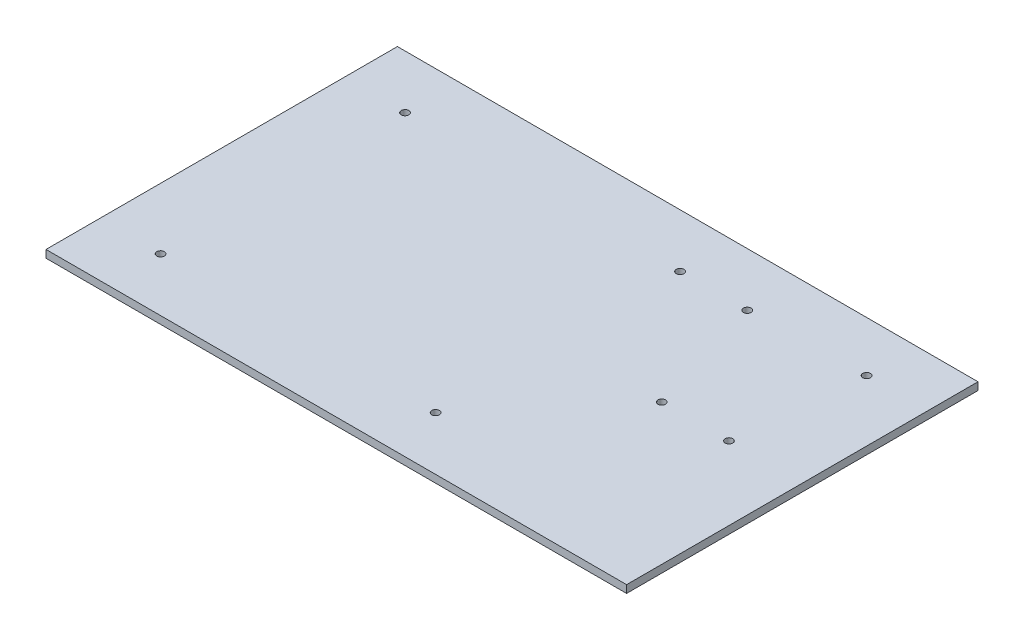
ISO-10303-21;
HEADER;
FILE_DESCRIPTION(('STEP AP214'),'2;1');
FILE_NAME('part.step','',(''),(''),'','','');
FILE_SCHEMA(('AUTOMOTIVE_DESIGN { 1 0 10303 214 1 1 1 1 }'));
ENDSEC;
DATA;
#1=APPLICATION_CONTEXT('core data for automotive mechanical design processes');
#2=APPLICATION_PROTOCOL_DEFINITION('international standard','automotive_design',2000,#1);
#3=PRODUCT_CONTEXT('',#1,'mechanical');
#4=PRODUCT('Part','Part','',(#3));
#5=PRODUCT_RELATED_PRODUCT_CATEGORY('part','',(#4));
#6=PRODUCT_DEFINITION_FORMATION('','',#4);
#7=PRODUCT_DEFINITION_CONTEXT('part definition',#1,'design');
#8=PRODUCT_DEFINITION('design','',#6,#7);
#9=PRODUCT_DEFINITION_SHAPE('','',#8);
#10=(LENGTH_UNIT() NAMED_UNIT(*) SI_UNIT(.MILLI.,.METRE.));
#11=(NAMED_UNIT(*) PLANE_ANGLE_UNIT() SI_UNIT($,.RADIAN.));
#12=(NAMED_UNIT(*) SI_UNIT($,.STERADIAN.) SOLID_ANGLE_UNIT());
#13=UNCERTAINTY_MEASURE_WITH_UNIT(LENGTH_MEASURE(1.E-05),#10,'distance_accuracy_value','');
#14=(GEOMETRIC_REPRESENTATION_CONTEXT(3) GLOBAL_UNCERTAINTY_ASSIGNED_CONTEXT((#13)) GLOBAL_UNIT_ASSIGNED_CONTEXT((#10,
#11,#12)) REPRESENTATION_CONTEXT('',''));
#15=CARTESIAN_POINT('',(0.,0.,0.));
#16=DIRECTION('',(0.,0.,1.));
#17=DIRECTION('',(1.,0.,0.));
#18=AXIS2_PLACEMENT_3D('',#15,#16,#17);
#19=CARTESIAN_POINT('',(120.65,3.175,0.));
#20=DIRECTION('',(1.,0.,0.));
#21=DIRECTION('',(0.,0.,-1.));
#22=AXIS2_PLACEMENT_3D('',#19,#20,#21);
#23=PLANE('',#22);
#24=DIRECTION('',(0.,0.,1.));
#25=VECTOR('',#24,1.);
#26=CARTESIAN_POINT('',(120.65,0.,0.));
#27=LINE('',#26,#25);
#28=CARTESIAN_POINT('',(120.65,0.,-73.025));
#29=VERTEX_POINT('',#28);
#30=CARTESIAN_POINT('',(120.65,0.,73.025));
#31=VERTEX_POINT('',#30);
#32=EDGE_CURVE('E129',#29,#31,#27,.T.);
#33=ORIENTED_EDGE('',*,*,#32,.F.);
#34=DIRECTION('',(0.,-1.,0.));
#35=VECTOR('',#34,1.);
#36=CARTESIAN_POINT('',(120.65,3.175,-73.025));
#37=LINE('',#36,#35);
#38=CARTESIAN_POINT('',(120.65,3.175,-73.025));
#39=VERTEX_POINT('',#38);
#40=EDGE_CURVE('E11',#39,#29,#37,.T.);
#41=ORIENTED_EDGE('',*,*,#40,.F.);
#42=DIRECTION('',(0.,0.,1.));
#43=VECTOR('',#42,1.);
#44=CARTESIAN_POINT('',(120.65,3.175,0.));
#45=LINE('',#44,#43);
#46=CARTESIAN_POINT('',(120.65,3.175,73.025));
#47=VERTEX_POINT('',#46);
#48=EDGE_CURVE('E98',#39,#47,#45,.T.);
#49=ORIENTED_EDGE('',*,*,#48,.T.);
#50=DIRECTION('',(0.,-1.,0.));
#51=VECTOR('',#50,1.);
#52=CARTESIAN_POINT('',(120.65,3.175,73.025));
#53=LINE('',#52,#51);
#54=EDGE_CURVE('E77',#47,#31,#53,.T.);
#55=ORIENTED_EDGE('',*,*,#54,.T.);
#56=EDGE_LOOP('',(#33,#41,#49,#55));
#57=FACE_BOUND('',#56,.T.);
#58=ADVANCED_FACE('F37',(#57),#23,.T.);
#59=CARTESIAN_POINT('',(0.,3.175,-73.025));
#60=DIRECTION('',(0.,0.,-1.));
#61=DIRECTION('',(-1.,0.,0.));
#62=AXIS2_PLACEMENT_3D('',#59,#60,#61);
#63=PLANE('',#62);
#64=DIRECTION('',(1.,0.,0.));
#65=VECTOR('',#64,1.);
#66=CARTESIAN_POINT('',(0.,0.,-73.025));
#67=LINE('',#66,#65);
#68=CARTESIAN_POINT('',(-120.65,0.,-73.025));
#69=VERTEX_POINT('',#68);
#70=EDGE_CURVE('E89',#69,#29,#67,.T.);
#71=ORIENTED_EDGE('',*,*,#70,.F.);
#72=DIRECTION('',(0.,-1.,0.));
#73=VECTOR('',#72,1.);
#74=CARTESIAN_POINT('',(-120.65,3.175,-73.025));
#75=LINE('',#74,#73);
#76=CARTESIAN_POINT('',(-120.65,3.175,-73.025));
#77=VERTEX_POINT('',#76);
#78=EDGE_CURVE('E46',#77,#69,#75,.T.);
#79=ORIENTED_EDGE('',*,*,#78,.F.);
#80=DIRECTION('',(1.,0.,0.));
#81=VECTOR('',#80,1.);
#82=CARTESIAN_POINT('',(0.,3.175,-73.025));
#83=LINE('',#82,#81);
#84=EDGE_CURVE('E87',#77,#39,#83,.T.);
#85=ORIENTED_EDGE('',*,*,#84,.T.);
#86=ORIENTED_EDGE('',*,*,#40,.T.);
#87=EDGE_LOOP('',(#71,#79,#85,#86));
#88=FACE_BOUND('',#87,.T.);
#89=ADVANCED_FACE('F85',(#88),#63,.T.);
#90=CARTESIAN_POINT('',(-120.65,3.175,0.));
#91=DIRECTION('',(1.,0.,0.));
#92=DIRECTION('',(0.,0.,-1.));
#93=AXIS2_PLACEMENT_3D('',#90,#91,#92);
#94=PLANE('',#93);
#95=DIRECTION('',(0.,0.,1.));
#96=VECTOR('',#95,1.);
#97=CARTESIAN_POINT('',(-120.65,0.,0.));
#98=LINE('',#97,#96);
#99=CARTESIAN_POINT('',(-120.65,0.,73.025));
#100=VERTEX_POINT('',#99);
#101=EDGE_CURVE('E132',#69,#100,#98,.T.);
#102=ORIENTED_EDGE('',*,*,#101,.T.);
#103=DIRECTION('',(0.,-1.,0.));
#104=VECTOR('',#103,1.);
#105=CARTESIAN_POINT('',(-120.65,3.175,73.025));
#106=LINE('',#105,#104);
#107=CARTESIAN_POINT('',(-120.65,3.175,73.025));
#108=VERTEX_POINT('',#107);
#109=EDGE_CURVE('E92',#108,#100,#106,.T.);
#110=ORIENTED_EDGE('',*,*,#109,.F.);
#111=DIRECTION('',(0.,0.,1.));
#112=VECTOR('',#111,1.);
#113=CARTESIAN_POINT('',(-120.65,3.175,0.));
#114=LINE('',#113,#112);
#115=EDGE_CURVE('E94',#77,#108,#114,.T.);
#116=ORIENTED_EDGE('',*,*,#115,.F.);
#117=ORIENTED_EDGE('',*,*,#78,.T.);
#118=EDGE_LOOP('',(#102,#110,#116,#117));
#119=FACE_BOUND('',#118,.T.);
#120=ADVANCED_FACE('F95',(#119),#94,.F.);
#121=CARTESIAN_POINT('',(62.2299999999999,3.175,0.));
#122=DIRECTION('',(0.,-1.,0.));
#123=DIRECTION('',(0.,0.,-1.));
#124=AXIS2_PLACEMENT_3D('',#121,#122,#123);
#125=CYLINDRICAL_SURFACE('',#124,1.58749999999998);
#126=CARTESIAN_POINT('',(62.2299999999999,3.175,0.));
#127=DIRECTION('',(0.,1.,0.));
#128=DIRECTION('',(0.,0.,1.));
#129=AXIS2_PLACEMENT_3D('',#126,#127,#128);
#130=CIRCLE('',#129,1.58749999999998);
#131=CARTESIAN_POINT('',(62.2299999999999,3.175,1.58749999999997));
#132=VERTEX_POINT('',#131);
#133=EDGE_CURVE('E100',#132,#132,#130,.T.);
#134=ORIENTED_EDGE('',*,*,#133,.T.);
#135=EDGE_LOOP('',(#134));
#136=FACE_BOUND('',#135,.T.);
#137=CARTESIAN_POINT('',(62.2299999999999,0.,0.));
#138=DIRECTION('',(0.,1.,0.));
#139=DIRECTION('',(0.,0.,1.));
#140=AXIS2_PLACEMENT_3D('',#137,#138,#139);
#141=CIRCLE('',#140,1.58749999999998);
#142=CARTESIAN_POINT('',(62.2299999999999,0.,1.58749999999997));
#143=VERTEX_POINT('',#142);
#144=EDGE_CURVE('E126',#143,#143,#141,.T.);
#145=ORIENTED_EDGE('',*,*,#144,.F.);
#146=EDGE_LOOP('',(#145));
#147=FACE_BOUND('',#146,.T.);
#148=ADVANCED_FACE('F148',(#136,#147),#125,.F.);
#149=CARTESIAN_POINT('',(46.9899999999999,3.175,-50.8));
#150=DIRECTION('',(0.,-1.,0.));
#151=DIRECTION('',(0.,0.,-1.));
#152=AXIS2_PLACEMENT_3D('',#149,#150,#151);
#153=CYLINDRICAL_SURFACE('',#152,1.58749999999999);
#154=CARTESIAN_POINT('',(46.9899999999999,3.175,-50.8));
#155=DIRECTION('',(0.,1.,0.));
#156=DIRECTION('',(0.,0.,1.));
#157=AXIS2_PLACEMENT_3D('',#154,#155,#156);
#158=CIRCLE('',#157,1.58749999999999);
#159=CARTESIAN_POINT('',(46.9899999999999,3.175,-49.2125));
#160=VERTEX_POINT('',#159);
#161=EDGE_CURVE('E316',#160,#160,#158,.T.);
#162=ORIENTED_EDGE('',*,*,#161,.T.);
#163=EDGE_LOOP('',(#162));
#164=FACE_BOUND('',#163,.T.);
#165=CARTESIAN_POINT('',(46.9899999999999,0.,-50.8));
#166=DIRECTION('',(0.,1.,0.));
#167=DIRECTION('',(0.,0.,1.));
#168=AXIS2_PLACEMENT_3D('',#165,#166,#167);
#169=CIRCLE('',#168,1.58749999999999);
#170=CARTESIAN_POINT('',(46.9899999999999,0.,-49.2125));
#171=VERTEX_POINT('',#170);
#172=EDGE_CURVE('E123',#171,#171,#169,.T.);
#173=ORIENTED_EDGE('',*,*,#172,.F.);
#174=EDGE_LOOP('',(#173));
#175=FACE_BOUND('',#174,.T.);
#176=ADVANCED_FACE('F151',(#164,#175),#153,.F.);
#177=CARTESIAN_POINT('',(95.2699999999999,3.175,-52.1));
#178=DIRECTION('',(0.,-1.,0.));
#179=DIRECTION('',(0.,0.,-1.));
#180=AXIS2_PLACEMENT_3D('',#177,#178,#179);
#181=CYLINDRICAL_SURFACE('',#180,1.5875);
#182=CARTESIAN_POINT('',(95.2699999999999,3.175,-52.1));
#183=DIRECTION('',(0.,1.,0.));
#184=DIRECTION('',(0.,0.,1.));
#185=AXIS2_PLACEMENT_3D('',#182,#183,#184);
#186=CIRCLE('',#185,1.5875);
#187=CARTESIAN_POINT('',(95.2699999999999,3.175,-50.5125));
#188=VERTEX_POINT('',#187);
#189=EDGE_CURVE('E312',#188,#188,#186,.T.);
#190=ORIENTED_EDGE('',*,*,#189,.T.);
#191=EDGE_LOOP('',(#190));
#192=FACE_BOUND('',#191,.T.);
#193=CARTESIAN_POINT('',(95.2699999999999,0.,-52.1));
#194=DIRECTION('',(0.,1.,0.));
#195=DIRECTION('',(0.,0.,1.));
#196=AXIS2_PLACEMENT_3D('',#193,#194,#195);
#197=CIRCLE('',#196,1.5875);
#198=CARTESIAN_POINT('',(95.2699999999999,0.,-50.5125));
#199=VERTEX_POINT('',#198);
#200=EDGE_CURVE('E120',#199,#199,#197,.T.);
#201=ORIENTED_EDGE('',*,*,#200,.F.);
#202=EDGE_LOOP('',(#201));
#203=FACE_BOUND('',#202,.T.);
#204=ADVANCED_FACE('F155',(#192,#203),#181,.F.);
#205=CARTESIAN_POINT('',(19.0499999999999,3.175,-50.8));
#206=DIRECTION('',(0.,-1.,0.));
#207=DIRECTION('',(0.,0.,-1.));
#208=AXIS2_PLACEMENT_3D('',#205,#206,#207);
#209=CYLINDRICAL_SURFACE('',#208,1.5875);
#210=CARTESIAN_POINT('',(19.0499999999999,3.175,-50.8));
#211=DIRECTION('',(0.,1.,0.));
#212=DIRECTION('',(0.,0.,1.));
#213=AXIS2_PLACEMENT_3D('',#210,#211,#212);
#214=CIRCLE('',#213,1.5875);
#215=CARTESIAN_POINT('',(19.0499999999999,3.175,-49.2125));
#216=VERTEX_POINT('',#215);
#217=EDGE_CURVE('E308',#216,#216,#214,.T.);
#218=ORIENTED_EDGE('',*,*,#217,.T.);
#219=EDGE_LOOP('',(#218));
#220=FACE_BOUND('',#219,.T.);
#221=CARTESIAN_POINT('',(19.0499999999999,0.,-50.8));
#222=DIRECTION('',(0.,1.,0.));
#223=DIRECTION('',(0.,0.,1.));
#224=AXIS2_PLACEMENT_3D('',#221,#222,#223);
#225=CIRCLE('',#224,1.5875);
#226=CARTESIAN_POINT('',(19.0499999999999,0.,-49.2125));
#227=VERTEX_POINT('',#226);
#228=EDGE_CURVE('E117',#227,#227,#225,.T.);
#229=ORIENTED_EDGE('',*,*,#228,.F.);
#230=EDGE_LOOP('',(#229));
#231=FACE_BOUND('',#230,.T.);
#232=ADVANCED_FACE('F159',(#220,#231),#209,.F.);
#233=CARTESIAN_POINT('',(90.1699999999999,3.175,0.));
#234=DIRECTION('',(0.,-1.,0.));
#235=DIRECTION('',(0.,0.,-1.));
#236=AXIS2_PLACEMENT_3D('',#233,#234,#235);
#237=CYLINDRICAL_SURFACE('',#236,1.58749999999999);
#238=CARTESIAN_POINT('',(90.1699999999999,3.175,0.));
#239=DIRECTION('',(0.,1.,0.));
#240=DIRECTION('',(0.,0.,1.));
#241=AXIS2_PLACEMENT_3D('',#238,#239,#240);
#242=CIRCLE('',#241,1.58749999999999);
#243=CARTESIAN_POINT('',(90.1699999999999,3.175,1.58749999999997));
#244=VERTEX_POINT('',#243);
#245=EDGE_CURVE('E304',#244,#244,#242,.T.);
#246=ORIENTED_EDGE('',*,*,#245,.T.);
#247=EDGE_LOOP('',(#246));
#248=FACE_BOUND('',#247,.T.);
#249=CARTESIAN_POINT('',(90.1699999999999,0.,0.));
#250=DIRECTION('',(0.,1.,0.));
#251=DIRECTION('',(0.,0.,1.));
#252=AXIS2_PLACEMENT_3D('',#249,#250,#251);
#253=CIRCLE('',#252,1.58749999999999);
#254=CARTESIAN_POINT('',(90.1699999999999,0.,1.58749999999997));
#255=VERTEX_POINT('',#254);
#256=EDGE_CURVE('E114',#255,#255,#253,.T.);
#257=ORIENTED_EDGE('',*,*,#256,.F.);
#258=EDGE_LOOP('',(#257));
#259=FACE_BOUND('',#258,.T.);
#260=ADVANCED_FACE('F163',(#248,#259),#237,.F.);
#261=CARTESIAN_POINT('',(-95.2500000000001,3.175,-50.8));
#262=DIRECTION('',(0.,-1.,0.));
#263=DIRECTION('',(0.,0.,-1.));
#264=AXIS2_PLACEMENT_3D('',#261,#262,#263);
#265=CYLINDRICAL_SURFACE('',#264,1.5875);
#266=CARTESIAN_POINT('',(-95.2500000000001,3.175,-50.8));
#267=DIRECTION('',(0.,1.,0.));
#268=DIRECTION('',(0.,0.,1.));
#269=AXIS2_PLACEMENT_3D('',#266,#267,#268);
#270=CIRCLE('',#269,1.5875);
#271=CARTESIAN_POINT('',(-95.2500000000001,3.175,-49.2125));
#272=VERTEX_POINT('',#271);
#273=EDGE_CURVE('E300',#272,#272,#270,.T.);
#274=ORIENTED_EDGE('',*,*,#273,.T.);
#275=EDGE_LOOP('',(#274));
#276=FACE_BOUND('',#275,.T.);
#277=CARTESIAN_POINT('',(-95.2500000000001,0.,-50.8));
#278=DIRECTION('',(0.,1.,0.));
#279=DIRECTION('',(0.,0.,1.));
#280=AXIS2_PLACEMENT_3D('',#277,#278,#279);
#281=CIRCLE('',#280,1.5875);
#282=CARTESIAN_POINT('',(-95.2500000000001,0.,-49.2125));
#283=VERTEX_POINT('',#282);
#284=EDGE_CURVE('E111',#283,#283,#281,.T.);
#285=ORIENTED_EDGE('',*,*,#284,.F.);
#286=EDGE_LOOP('',(#285));
#287=FACE_BOUND('',#286,.T.);
#288=ADVANCED_FACE('F167',(#276,#287),#265,.F.);
#289=CARTESIAN_POINT('',(19.0499999999999,3.175,50.8));
#290=DIRECTION('',(0.,-1.,0.));
#291=DIRECTION('',(0.,0.,-1.));
#292=AXIS2_PLACEMENT_3D('',#289,#290,#291);
#293=CYLINDRICAL_SURFACE('',#292,1.5875);
#294=CARTESIAN_POINT('',(19.0499999999999,3.175,50.8));
#295=DIRECTION('',(0.,1.,0.));
#296=DIRECTION('',(0.,0.,1.));
#297=AXIS2_PLACEMENT_3D('',#294,#295,#296);
#298=CIRCLE('',#297,1.5875);
#299=CARTESIAN_POINT('',(19.0499999999999,3.175,52.3875));
#300=VERTEX_POINT('',#299);
#301=EDGE_CURVE('E181',#300,#300,#298,.T.);
#302=ORIENTED_EDGE('',*,*,#301,.T.);
#303=EDGE_LOOP('',(#302));
#304=FACE_BOUND('',#303,.T.);
#305=CARTESIAN_POINT('',(19.0499999999999,0.,50.8));
#306=DIRECTION('',(0.,1.,0.));
#307=DIRECTION('',(0.,0.,1.));
#308=AXIS2_PLACEMENT_3D('',#305,#306,#307);
#309=CIRCLE('',#308,1.5875);
#310=CARTESIAN_POINT('',(19.0499999999999,0.,52.3875));
#311=VERTEX_POINT('',#310);
#312=EDGE_CURVE('E108',#311,#311,#309,.T.);
#313=ORIENTED_EDGE('',*,*,#312,.F.);
#314=EDGE_LOOP('',(#313));
#315=FACE_BOUND('',#314,.T.);
#316=ADVANCED_FACE('F170',(#304,#315),#293,.F.);
#317=CARTESIAN_POINT('',(-95.2500000000001,3.175,50.8));
#318=DIRECTION('',(0.,-1.,0.));
#319=DIRECTION('',(0.,0.,-1.));
#320=AXIS2_PLACEMENT_3D('',#317,#318,#319);
#321=CYLINDRICAL_SURFACE('',#320,1.5875);
#322=CARTESIAN_POINT('',(-95.2500000000001,3.175,50.8));
#323=DIRECTION('',(0.,1.,0.));
#324=DIRECTION('',(0.,0.,1.));
#325=AXIS2_PLACEMENT_3D('',#322,#323,#324);
#326=CIRCLE('',#325,1.5875);
#327=CARTESIAN_POINT('',(-95.2500000000001,3.175,52.3875));
#328=VERTEX_POINT('',#327);
#329=EDGE_CURVE('E135',#328,#328,#326,.T.);
#330=ORIENTED_EDGE('',*,*,#329,.T.);
#331=EDGE_LOOP('',(#330));
#332=FACE_BOUND('',#331,.T.);
#333=CARTESIAN_POINT('',(-95.2500000000001,0.,50.8));
#334=DIRECTION('',(0.,1.,0.));
#335=DIRECTION('',(0.,0.,1.));
#336=AXIS2_PLACEMENT_3D('',#333,#334,#335);
#337=CIRCLE('',#336,1.5875);
#338=CARTESIAN_POINT('',(-95.2500000000001,0.,52.3875));
#339=VERTEX_POINT('',#338);
#340=EDGE_CURVE('E105',#339,#339,#337,.T.);
#341=ORIENTED_EDGE('',*,*,#340,.F.);
#342=EDGE_LOOP('',(#341));
#343=FACE_BOUND('',#342,.T.);
#344=ADVANCED_FACE('F39',(#332,#343),#321,.F.);
#345=CARTESIAN_POINT('',(0.,3.175,73.025));
#346=DIRECTION('',(0.,0.,-1.));
#347=DIRECTION('',(-1.,0.,0.));
#348=AXIS2_PLACEMENT_3D('',#345,#346,#347);
#349=PLANE('',#348);
#350=DIRECTION('',(1.,0.,0.));
#351=VECTOR('',#350,1.);
#352=CARTESIAN_POINT('',(0.,0.,73.025));
#353=LINE('',#352,#351);
#354=EDGE_CURVE('E70',#100,#31,#353,.T.);
#355=ORIENTED_EDGE('',*,*,#354,.T.);
#356=ORIENTED_EDGE('',*,*,#54,.F.);
#357=DIRECTION('',(1.,0.,0.));
#358=VECTOR('',#357,1.);
#359=CARTESIAN_POINT('',(0.,3.175,73.025));
#360=LINE('',#359,#358);
#361=EDGE_CURVE('E54',#108,#47,#360,.T.);
#362=ORIENTED_EDGE('',*,*,#361,.F.);
#363=ORIENTED_EDGE('',*,*,#109,.T.);
#364=EDGE_LOOP('',(#355,#356,#362,#363));
#365=FACE_BOUND('',#364,.T.);
#366=ADVANCED_FACE('F138',(#365),#349,.F.);
#367=CARTESIAN_POINT('',(0.,3.175,0.));
#368=DIRECTION('',(0.,1.,0.));
#369=DIRECTION('',(0.,0.,1.));
#370=AXIS2_PLACEMENT_3D('',#367,#368,#369);
#371=PLANE('',#370);
#372=ORIENTED_EDGE('',*,*,#329,.F.);
#373=EDGE_LOOP('',(#372));
#374=FACE_BOUND('',#373,.T.);
#375=ORIENTED_EDGE('',*,*,#301,.F.);
#376=EDGE_LOOP('',(#375));
#377=FACE_BOUND('',#376,.T.);
#378=ORIENTED_EDGE('',*,*,#273,.F.);
#379=EDGE_LOOP('',(#378));
#380=FACE_BOUND('',#379,.T.);
#381=ORIENTED_EDGE('',*,*,#245,.F.);
#382=EDGE_LOOP('',(#381));
#383=FACE_BOUND('',#382,.T.);
#384=ORIENTED_EDGE('',*,*,#217,.F.);
#385=EDGE_LOOP('',(#384));
#386=FACE_BOUND('',#385,.T.);
#387=ORIENTED_EDGE('',*,*,#189,.F.);
#388=EDGE_LOOP('',(#387));
#389=FACE_BOUND('',#388,.T.);
#390=ORIENTED_EDGE('',*,*,#161,.F.);
#391=EDGE_LOOP('',(#390));
#392=FACE_BOUND('',#391,.T.);
#393=ORIENTED_EDGE('',*,*,#133,.F.);
#394=EDGE_LOOP('',(#393));
#395=FACE_BOUND('',#394,.T.);
#396=ORIENTED_EDGE('',*,*,#48,.F.);
#397=ORIENTED_EDGE('',*,*,#84,.F.);
#398=ORIENTED_EDGE('',*,*,#115,.T.);
#399=ORIENTED_EDGE('',*,*,#361,.T.);
#400=EDGE_LOOP('',(#396,#397,#398,#399));
#401=FACE_BOUND('',#400,.T.);
#402=ADVANCED_FACE('F97',(#374,#377,#380,#383,#386,#389,#392,#395,#401),#371,.T.);
#403=CARTESIAN_POINT('',(0.,0.,0.));
#404=DIRECTION('',(0.,1.,0.));
#405=DIRECTION('',(0.,0.,1.));
#406=AXIS2_PLACEMENT_3D('',#403,#404,#405);
#407=PLANE('',#406);
#408=ORIENTED_EDGE('',*,*,#340,.T.);
#409=EDGE_LOOP('',(#408));
#410=FACE_BOUND('',#409,.T.);
#411=ORIENTED_EDGE('',*,*,#312,.T.);
#412=EDGE_LOOP('',(#411));
#413=FACE_BOUND('',#412,.T.);
#414=ORIENTED_EDGE('',*,*,#284,.T.);
#415=EDGE_LOOP('',(#414));
#416=FACE_BOUND('',#415,.T.);
#417=ORIENTED_EDGE('',*,*,#256,.T.);
#418=EDGE_LOOP('',(#417));
#419=FACE_BOUND('',#418,.T.);
#420=ORIENTED_EDGE('',*,*,#228,.T.);
#421=EDGE_LOOP('',(#420));
#422=FACE_BOUND('',#421,.T.);
#423=ORIENTED_EDGE('',*,*,#200,.T.);
#424=EDGE_LOOP('',(#423));
#425=FACE_BOUND('',#424,.T.);
#426=ORIENTED_EDGE('',*,*,#172,.T.);
#427=EDGE_LOOP('',(#426));
#428=FACE_BOUND('',#427,.T.);
#429=ORIENTED_EDGE('',*,*,#144,.T.);
#430=EDGE_LOOP('',(#429));
#431=FACE_BOUND('',#430,.T.);
#432=ORIENTED_EDGE('',*,*,#32,.T.);
#433=ORIENTED_EDGE('',*,*,#354,.F.);
#434=ORIENTED_EDGE('',*,*,#101,.F.);
#435=ORIENTED_EDGE('',*,*,#70,.T.);
#436=EDGE_LOOP('',(#432,#433,#434,#435));
#437=FACE_BOUND('',#436,.T.);
#438=ADVANCED_FACE('F139',(#410,#413,#416,#419,#422,#425,#428,#431,#437),#407,.F.);
#439=CLOSED_SHELL('',(#58,#89,#120,#148,#176,#204,#232,#260,#288,#316,#344,#366,#402,#438));
#440=MANIFOLD_SOLID_BREP('B2',#439);
#441=ADVANCED_BREP_SHAPE_REPRESENTATION('',(#18,#440),#14);
#442=SHAPE_DEFINITION_REPRESENTATION(#9,#441);
ENDSEC;
END-ISO-10303-21;
